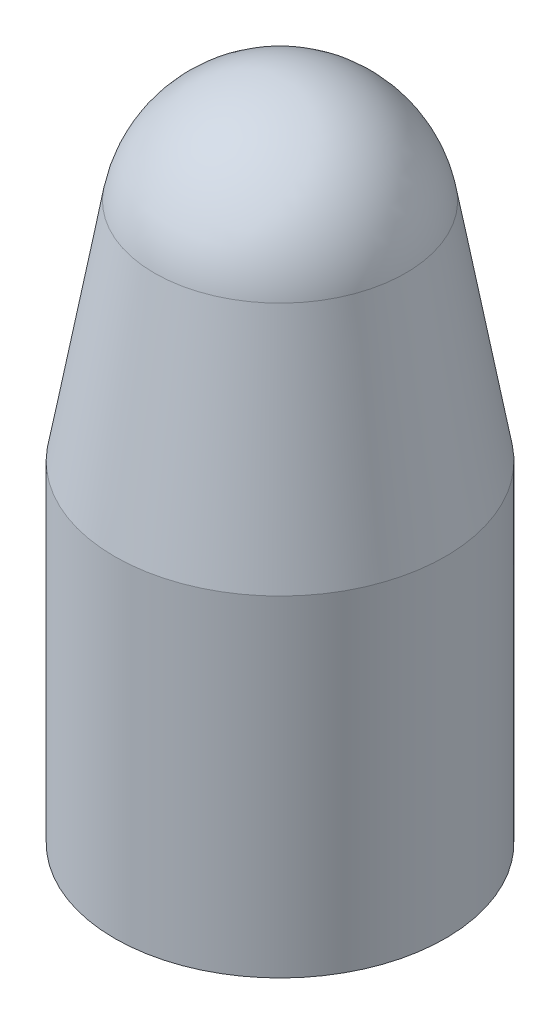
ISO-10303-21;
HEADER;
FILE_DESCRIPTION(('STEP AP214'),'2;1');
FILE_NAME('part.step','',(''),(''),'','','');
FILE_SCHEMA(('AUTOMOTIVE_DESIGN { 1 0 10303 214 1 1 1 1 }'));
ENDSEC;
DATA;
#1=APPLICATION_CONTEXT('core data for automotive mechanical design processes');
#2=APPLICATION_PROTOCOL_DEFINITION('international standard','automotive_design',2000,#1);
#3=PRODUCT_CONTEXT('',#1,'mechanical');
#4=PRODUCT('Part','Part','',(#3));
#5=PRODUCT_RELATED_PRODUCT_CATEGORY('part','',(#4));
#6=PRODUCT_DEFINITION_FORMATION('','',#4);
#7=PRODUCT_DEFINITION_CONTEXT('part definition',#1,'design');
#8=PRODUCT_DEFINITION('design','',#6,#7);
#9=PRODUCT_DEFINITION_SHAPE('','',#8);
#10=(LENGTH_UNIT() NAMED_UNIT(*) SI_UNIT(.MILLI.,.METRE.));
#11=(NAMED_UNIT(*) PLANE_ANGLE_UNIT() SI_UNIT($,.RADIAN.));
#12=(NAMED_UNIT(*) SI_UNIT($,.STERADIAN.) SOLID_ANGLE_UNIT());
#13=UNCERTAINTY_MEASURE_WITH_UNIT(LENGTH_MEASURE(1.E-05),#10,'distance_accuracy_value','');
#14=(GEOMETRIC_REPRESENTATION_CONTEXT(3) GLOBAL_UNCERTAINTY_ASSIGNED_CONTEXT((#13)) GLOBAL_UNIT_ASSIGNED_CONTEXT((#10,
#11,#12)) REPRESENTATION_CONTEXT('',''));
#15=CARTESIAN_POINT('',(0.,0.,0.));
#16=DIRECTION('',(0.,0.,1.));
#17=DIRECTION('',(1.,0.,0.));
#18=AXIS2_PLACEMENT_3D('',#15,#16,#17);
#19=CARTESIAN_POINT('',(0.,0.,0.));
#20=DIRECTION('',(0.,-1.,0.));
#21=DIRECTION('',(0.,0.,1.));
#22=AXIS2_PLACEMENT_3D('',#19,#20,#21);
#23=CONICAL_SURFACE('',#22,5.,0.174532925199433);
#24=CARTESIAN_POINT('',(0.,6.81854548401768,0.));
#25=DIRECTION('',(0.,-1.,0.));
#26=DIRECTION('',(0.,0.,-1.));
#27=AXIS2_PLACEMENT_3D('',#24,#25,#26);
#28=CIRCLE('',#27,3.79770646197982);
#29=CARTESIAN_POINT('',(0.,6.81854548401768,-3.79770646197982));
#30=VERTEX_POINT('',#29);
#31=EDGE_CURVE('E10',#30,#30,#28,.T.);
#32=ORIENTED_EDGE('',*,*,#31,.T.);
#33=EDGE_LOOP('',(#32));
#34=FACE_BOUND('',#33,.T.);
#35=CARTESIAN_POINT('',(0.,0.,0.));
#36=DIRECTION('',(0.,1.,0.));
#37=DIRECTION('',(0.,0.,1.));
#38=AXIS2_PLACEMENT_3D('',#35,#36,#37);
#39=CIRCLE('',#38,5.);
#40=CARTESIAN_POINT('',(0.,0.,5.));
#41=VERTEX_POINT('',#40);
#42=EDGE_CURVE('E49',#41,#41,#39,.T.);
#43=ORIENTED_EDGE('',*,*,#42,.T.);
#44=EDGE_LOOP('',(#43));
#45=FACE_BOUND('',#44,.T.);
#46=ADVANCED_FACE('F34',(#34,#45),#23,.T.);
#47=CARTESIAN_POINT('',(0.,10.,0.));
#48=DIRECTION('',(0.,1.,0.));
#49=DIRECTION('',(0.,0.,1.));
#50=AXIS2_PLACEMENT_3D('',#47,#48,#49);
#51=PLANE('',#50);
#52=CARTESIAN_POINT('',(0.,10.,0.));
#53=DIRECTION('',(0.,1.,0.));
#54=DIRECTION('',(0.,0.,1.));
#55=AXIS2_PLACEMENT_3D('',#52,#53,#54);
#56=CIRCLE('',#55,0.00619661288282158);
#57=CARTESIAN_POINT('',(0.,10.,0.00619661288282158));
#58=VERTEX_POINT('',#57);
#59=EDGE_CURVE('E41',#58,#58,#56,.T.);
#60=ORIENTED_EDGE('',*,*,#59,.T.);
#61=EDGE_LOOP('',(#60));
#62=FACE_BOUND('',#61,.T.);
#63=ADVANCED_FACE('F90',(#62),#51,.T.);
#64=CARTESIAN_POINT('',(0.,-10.,0.));
#65=DIRECTION('',(0.,1.,0.));
#66=DIRECTION('',(0.,0.,1.));
#67=AXIS2_PLACEMENT_3D('',#64,#65,#66);
#68=CYLINDRICAL_SURFACE('',#67,5.);
#69=CARTESIAN_POINT('',(0.,-10.,0.));
#70=DIRECTION('',(0.,1.,0.));
#71=DIRECTION('',(0.,0.,1.));
#72=AXIS2_PLACEMENT_3D('',#69,#70,#71);
#73=CIRCLE('',#72,5.);
#74=CARTESIAN_POINT('',(0.,-10.,5.));
#75=VERTEX_POINT('',#74);
#76=EDGE_CURVE('E45',#75,#75,#73,.T.);
#77=ORIENTED_EDGE('',*,*,#76,.T.);
#78=EDGE_LOOP('',(#77));
#79=FACE_BOUND('',#78,.T.);
#80=ORIENTED_EDGE('',*,*,#42,.F.);
#81=EDGE_LOOP('',(#80));
#82=FACE_BOUND('',#81,.T.);
#83=ADVANCED_FACE('F94',(#79,#82),#68,.T.);
#84=CARTESIAN_POINT('',(0.,-10.,0.));
#85=DIRECTION('',(0.,1.,0.));
#86=DIRECTION('',(0.,0.,1.));
#87=AXIS2_PLACEMENT_3D('',#84,#85,#86);
#88=PLANE('',#87);
#89=CARTESIAN_POINT('',(0.,-10.,0.));
#90=DIRECTION('',(0.,1.,0.));
#91=DIRECTION('',(0.,0.,1.));
#92=AXIS2_PLACEMENT_3D('',#89,#90,#91);
#93=CIRCLE('',#92,2.5);
#94=CARTESIAN_POINT('',(0.,-10.,2.5));
#95=VERTEX_POINT('',#94);
#96=EDGE_CURVE('E55',#95,#95,#93,.T.);
#97=ORIENTED_EDGE('',*,*,#96,.T.);
#98=EDGE_LOOP('',(#97));
#99=FACE_BOUND('',#98,.T.);
#100=ORIENTED_EDGE('',*,*,#76,.F.);
#101=EDGE_LOOP('',(#100));
#102=FACE_BOUND('',#101,.T.);
#103=ADVANCED_FACE('F100',(#99,#102),#88,.F.);
#104=CARTESIAN_POINT('',(0.,6.15,0.));
#105=DIRECTION('',(0.,1.,0.));
#106=DIRECTION('',(0.,0.,1.));
#107=AXIS2_PLACEMENT_3D('',#104,#105,#106);
#108=DEGENERATE_TOROIDAL_SURFACE('',#107,0.00619661288282158,3.85,.T.);
#109=ORIENTED_EDGE('',*,*,#31,.F.);
#110=EDGE_LOOP('',(#109));
#111=FACE_BOUND('',#110,.T.);
#112=ORIENTED_EDGE('',*,*,#59,.F.);
#113=EDGE_LOOP('',(#112));
#114=FACE_BOUND('',#113,.T.);
#115=ADVANCED_FACE('F36',(#111,#114),#108,.T.);
#116=CARTESIAN_POINT('',(0.,-0.434120444167326,0.));
#117=DIRECTION('',(0.,-1.,0.));
#118=DIRECTION('',(0.,0.,1.));
#119=AXIS2_PLACEMENT_3D('',#116,#117,#118);
#120=CONICAL_SURFACE('',#119,2.53798061746948,0.174532925199433);
#121=CARTESIAN_POINT('',(0.,6.38442503985036,0.));
#122=DIRECTION('',(0.,-1.,0.));
#123=DIRECTION('',(0.,0.,-1.));
#124=AXIS2_PLACEMENT_3D('',#121,#122,#123);
#125=CIRCLE('',#124,1.3356870794493);
#126=CARTESIAN_POINT('',(0.,6.38442503985036,-1.3356870794493));
#127=VERTEX_POINT('',#126);
#128=EDGE_CURVE('E53',#127,#127,#125,.T.);
#129=ORIENTED_EDGE('',*,*,#128,.F.);
#130=EDGE_LOOP('',(#129));
#131=FACE_BOUND('',#130,.T.);
#132=CARTESIAN_POINT('',(0.,-0.218721658814809,0.));
#133=DIRECTION('',(0.,-1.,0.));
#134=DIRECTION('',(0.,0.,-1.));
#135=AXIS2_PLACEMENT_3D('',#132,#133,#134);
#136=CIRCLE('',#135,2.5);
#137=CARTESIAN_POINT('',(0.,-0.218721658814809,-2.5));
#138=VERTEX_POINT('',#137);
#139=EDGE_CURVE('E59',#138,#138,#136,.F.);
#140=ORIENTED_EDGE('',*,*,#139,.F.);
#141=EDGE_LOOP('',(#140));
#142=FACE_BOUND('',#141,.T.);
#143=ADVANCED_FACE('F70',(#131,#142),#120,.F.);
#144=CARTESIAN_POINT('',(0.,7.5,0.));
#145=DIRECTION('',(0.,1.,0.));
#146=DIRECTION('',(0.,0.,1.));
#147=AXIS2_PLACEMENT_3D('',#144,#145,#146);
#148=PLANE('',#147);
#149=CARTESIAN_POINT('',(0.,7.5,0.));
#150=DIRECTION('',(0.,1.,0.));
#151=DIRECTION('',(0.,0.,1.));
#152=AXIS2_PLACEMENT_3D('',#149,#150,#151);
#153=CIRCLE('',#152,0.00619661288282167);
#154=CARTESIAN_POINT('',(0.,7.5,0.00619661288282167));
#155=VERTEX_POINT('',#154);
#156=EDGE_CURVE('E58',#155,#155,#153,.T.);
#157=ORIENTED_EDGE('',*,*,#156,.F.);
#158=EDGE_LOOP('',(#157));
#159=FACE_BOUND('',#158,.T.);
#160=ADVANCED_FACE('F73',(#159),#148,.F.);
#161=CARTESIAN_POINT('',(0.,-10.,0.));
#162=DIRECTION('',(0.,1.,0.));
#163=DIRECTION('',(0.,0.,1.));
#164=AXIS2_PLACEMENT_3D('',#161,#162,#163);
#165=CYLINDRICAL_SURFACE('',#164,2.5);
#166=ORIENTED_EDGE('',*,*,#96,.F.);
#167=EDGE_LOOP('',(#166));
#168=FACE_BOUND('',#167,.T.);
#169=ORIENTED_EDGE('',*,*,#139,.T.);
#170=EDGE_LOOP('',(#169));
#171=FACE_BOUND('',#170,.T.);
#172=ADVANCED_FACE('F77',(#168,#171),#165,.F.);
#173=CARTESIAN_POINT('',(0.,6.15,0.));
#174=DIRECTION('',(0.,1.,0.));
#175=DIRECTION('',(0.,0.,1.));
#176=AXIS2_PLACEMENT_3D('',#173,#174,#175);
#177=DEGENERATE_TOROIDAL_SURFACE('',#176,0.00619661288282158,1.35,.T.);
#178=ORIENTED_EDGE('',*,*,#128,.T.);
#179=EDGE_LOOP('',(#178));
#180=FACE_BOUND('',#179,.T.);
#181=ORIENTED_EDGE('',*,*,#156,.T.);
#182=EDGE_LOOP('',(#181));
#183=FACE_BOUND('',#182,.T.);
#184=ADVANCED_FACE('F67',(#180,#183),#177,.F.);
#185=CLOSED_SHELL('',(#46,#63,#83,#103,#115,#143,#160,#172,#184));
#186=MANIFOLD_SOLID_BREP('B2',#185);
#187=ADVANCED_BREP_SHAPE_REPRESENTATION('',(#18,#186),#14);
#188=SHAPE_DEFINITION_REPRESENTATION(#9,#187);
ENDSEC;
END-ISO-10303-21;
